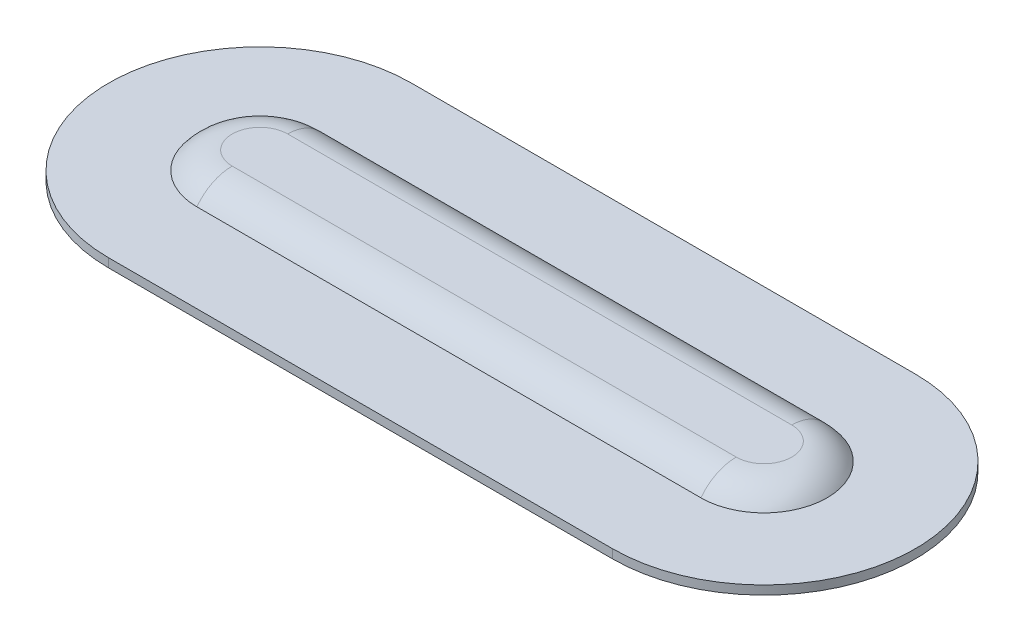
ISO-10303-21;
HEADER;
FILE_DESCRIPTION(('STEP AP214'),'2;1');
FILE_NAME('part.step','',(''),(''),'','','');
FILE_SCHEMA(('AUTOMOTIVE_DESIGN { 1 0 10303 214 1 1 1 1 }'));
ENDSEC;
DATA;
#1=APPLICATION_CONTEXT('core data for automotive mechanical design processes');
#2=APPLICATION_PROTOCOL_DEFINITION('international standard','automotive_design',2000,#1);
#3=PRODUCT_CONTEXT('',#1,'mechanical');
#4=PRODUCT('Part','Part','',(#3));
#5=PRODUCT_RELATED_PRODUCT_CATEGORY('part','',(#4));
#6=PRODUCT_DEFINITION_FORMATION('','',#4);
#7=PRODUCT_DEFINITION_CONTEXT('part definition',#1,'design');
#8=PRODUCT_DEFINITION('design','',#6,#7);
#9=PRODUCT_DEFINITION_SHAPE('','',#8);
#10=(LENGTH_UNIT() NAMED_UNIT(*) SI_UNIT(.MILLI.,.METRE.));
#11=(NAMED_UNIT(*) PLANE_ANGLE_UNIT() SI_UNIT($,.RADIAN.));
#12=(NAMED_UNIT(*) SI_UNIT($,.STERADIAN.) SOLID_ANGLE_UNIT());
#13=UNCERTAINTY_MEASURE_WITH_UNIT(LENGTH_MEASURE(1.E-05),#10,'distance_accuracy_value','');
#14=(GEOMETRIC_REPRESENTATION_CONTEXT(3) GLOBAL_UNCERTAINTY_ASSIGNED_CONTEXT((#13)) GLOBAL_UNIT_ASSIGNED_CONTEXT((#10,
#11,#12)) REPRESENTATION_CONTEXT('',''));
#15=CARTESIAN_POINT('',(0.,0.,0.));
#16=DIRECTION('',(0.,0.,1.));
#17=DIRECTION('',(1.,0.,0.));
#18=AXIS2_PLACEMENT_3D('',#15,#16,#17);
#19=CARTESIAN_POINT('',(-28.55625,1.,0.));
#20=DIRECTION('',(0.,-1.,0.));
#21=DIRECTION('',(0.,0.,-1.));
#22=AXIS2_PLACEMENT_3D('',#19,#20,#21);
#23=CYLINDRICAL_SURFACE('',#22,17.1489758704796);
#24=CARTESIAN_POINT('',(-28.55625,0.,0.));
#25=DIRECTION('',(0.,1.,0.));
#26=DIRECTION('',(0.,0.,1.));
#27=AXIS2_PLACEMENT_3D('',#24,#25,#26);
#28=CIRCLE('',#27,17.1489758704796);
#29=CARTESIAN_POINT('',(-28.55625,0.,-17.1489758704796));
#30=VERTEX_POINT('',#29);
#31=CARTESIAN_POINT('',(-28.55625,0.,17.1489758704796));
#32=VERTEX_POINT('',#31);
#33=EDGE_CURVE('E184',#30,#32,#28,.T.);
#34=ORIENTED_EDGE('',*,*,#33,.T.);
#35=DIRECTION('',(0.,-1.,0.));
#36=VECTOR('',#35,1.);
#37=CARTESIAN_POINT('',(-28.55625,1.,17.1489758704796));
#38=LINE('',#37,#36);
#39=CARTESIAN_POINT('',(-28.55625,1.,17.1489758704796));
#40=VERTEX_POINT('',#39);
#41=EDGE_CURVE('E169',#40,#32,#38,.T.);
#42=ORIENTED_EDGE('',*,*,#41,.F.);
#43=CARTESIAN_POINT('',(-28.55625,1.,0.));
#44=DIRECTION('',(0.,1.,0.));
#45=DIRECTION('',(0.,0.,1.));
#46=AXIS2_PLACEMENT_3D('',#43,#44,#45);
#47=CIRCLE('',#46,17.1489758704796);
#48=CARTESIAN_POINT('',(-28.55625,1.,-17.1489758704796));
#49=VERTEX_POINT('',#48);
#50=EDGE_CURVE('E192',#49,#40,#47,.T.);
#51=ORIENTED_EDGE('',*,*,#50,.F.);
#52=DIRECTION('',(0.,-1.,0.));
#53=VECTOR('',#52,1.);
#54=CARTESIAN_POINT('',(-28.55625,1.,-17.1489758704796));
#55=LINE('',#54,#53);
#56=EDGE_CURVE('E266',#49,#30,#55,.T.);
#57=ORIENTED_EDGE('',*,*,#56,.T.);
#58=EDGE_LOOP('',(#34,#42,#51,#57));
#59=FACE_BOUND('',#58,.T.);
#60=ADVANCED_FACE('F42',(#59),#23,.T.);
#61=CARTESIAN_POINT('',(-28.55625,1.,17.1489758704796));
#62=DIRECTION('',(0.,0.,-1.));
#63=DIRECTION('',(-1.,0.,0.));
#64=AXIS2_PLACEMENT_3D('',#61,#62,#63);
#65=PLANE('',#64);
#66=DIRECTION('',(1.,0.,0.));
#67=VECTOR('',#66,1.);
#68=CARTESIAN_POINT('',(-28.55625,0.,17.1489758704796));
#69=LINE('',#68,#67);
#70=CARTESIAN_POINT('',(28.55625,0.,17.1489758704796));
#71=VERTEX_POINT('',#70);
#72=EDGE_CURVE('E187',#32,#71,#69,.T.);
#73=ORIENTED_EDGE('',*,*,#72,.T.);
#74=DIRECTION('',(0.,-1.,0.));
#75=VECTOR('',#74,1.);
#76=CARTESIAN_POINT('',(28.55625,1.,17.1489758704796));
#77=LINE('',#76,#75);
#78=CARTESIAN_POINT('',(28.55625,1.,17.1489758704796));
#79=VERTEX_POINT('',#78);
#80=EDGE_CURVE('E174',#79,#71,#77,.T.);
#81=ORIENTED_EDGE('',*,*,#80,.F.);
#82=DIRECTION('',(1.,0.,0.));
#83=VECTOR('',#82,1.);
#84=CARTESIAN_POINT('',(-28.55625,1.,17.1489758704796));
#85=LINE('',#84,#83);
#86=EDGE_CURVE('E436',#40,#79,#85,.T.);
#87=ORIENTED_EDGE('',*,*,#86,.F.);
#88=ORIENTED_EDGE('',*,*,#41,.T.);
#89=EDGE_LOOP('',(#73,#81,#87,#88));
#90=FACE_BOUND('',#89,.T.);
#91=ADVANCED_FACE('F451',(#90),#65,.F.);
#92=CARTESIAN_POINT('',(28.55625,1.,0.));
#93=DIRECTION('',(0.,-1.,0.));
#94=DIRECTION('',(0.,0.,-1.));
#95=AXIS2_PLACEMENT_3D('',#92,#93,#94);
#96=CYLINDRICAL_SURFACE('',#95,17.1489758704796);
#97=CARTESIAN_POINT('',(28.55625,0.,0.));
#98=DIRECTION('',(0.,1.,0.));
#99=DIRECTION('',(0.,0.,1.));
#100=AXIS2_PLACEMENT_3D('',#97,#98,#99);
#101=CIRCLE('',#100,17.1489758704796);
#102=CARTESIAN_POINT('',(28.55625,0.,-17.1489758704796));
#103=VERTEX_POINT('',#102);
#104=EDGE_CURVE('E214',#71,#103,#101,.T.);
#105=ORIENTED_EDGE('',*,*,#104,.T.);
#106=DIRECTION('',(0.,-1.,0.));
#107=VECTOR('',#106,1.);
#108=CARTESIAN_POINT('',(28.55625,1.,-17.1489758704796));
#109=LINE('',#108,#107);
#110=CARTESIAN_POINT('',(28.55625,1.,-17.1489758704796));
#111=VERTEX_POINT('',#110);
#112=EDGE_CURVE('E269',#111,#103,#109,.T.);
#113=ORIENTED_EDGE('',*,*,#112,.F.);
#114=CARTESIAN_POINT('',(28.55625,1.,0.));
#115=DIRECTION('',(0.,1.,0.));
#116=DIRECTION('',(0.,0.,1.));
#117=AXIS2_PLACEMENT_3D('',#114,#115,#116);
#118=CIRCLE('',#117,17.1489758704796);
#119=EDGE_CURVE('E425',#79,#111,#118,.T.);
#120=ORIENTED_EDGE('',*,*,#119,.F.);
#121=ORIENTED_EDGE('',*,*,#80,.T.);
#122=EDGE_LOOP('',(#105,#113,#120,#121));
#123=FACE_BOUND('',#122,.T.);
#124=ADVANCED_FACE('F424',(#123),#96,.T.);
#125=CARTESIAN_POINT('',(-28.55625,1.,-17.1489758704796));
#126=DIRECTION('',(0.,0.,1.));
#127=DIRECTION('',(1.,0.,0.));
#128=AXIS2_PLACEMENT_3D('',#125,#126,#127);
#129=PLANE('',#128);
#130=DIRECTION('',(-1.,0.,0.));
#131=VECTOR('',#130,1.);
#132=CARTESIAN_POINT('',(-28.55625,0.,-17.1489758704796));
#133=LINE('',#132,#131);
#134=EDGE_CURVE('E264',#103,#30,#133,.T.);
#135=ORIENTED_EDGE('',*,*,#134,.T.);
#136=ORIENTED_EDGE('',*,*,#56,.F.);
#137=DIRECTION('',(-1.,0.,0.));
#138=VECTOR('',#137,1.);
#139=CARTESIAN_POINT('',(-28.55625,1.,-17.1489758704796));
#140=LINE('',#139,#138);
#141=EDGE_CURVE('E210',#111,#49,#140,.T.);
#142=ORIENTED_EDGE('',*,*,#141,.F.);
#143=ORIENTED_EDGE('',*,*,#112,.T.);
#144=EDGE_LOOP('',(#135,#136,#142,#143));
#145=FACE_BOUND('',#144,.T.);
#146=ADVANCED_FACE('F431',(#145),#129,.F.);
#147=CARTESIAN_POINT('',(-28.55625,1.,0.));
#148=DIRECTION('',(0.,1.,0.));
#149=DIRECTION('',(0.,0.,1.));
#150=AXIS2_PLACEMENT_3D('',#147,#148,#149);
#151=PLANE('',#150);
#152=CARTESIAN_POINT('',(-28.55625,1.,0.));
#153=DIRECTION('',(0.,1.,0.));
#154=DIRECTION('',(0.,0.,1.));
#155=AXIS2_PLACEMENT_3D('',#152,#153,#154);
#156=CIRCLE('',#155,7.14897587047956);
#157=CARTESIAN_POINT('',(-28.55625,1.,-7.14897587047957));
#158=VERTEX_POINT('',#157);
#159=CARTESIAN_POINT('',(-28.55625,1.,7.14897587047955));
#160=VERTEX_POINT('',#159);
#161=EDGE_CURVE('E123',#158,#160,#156,.T.);
#162=ORIENTED_EDGE('',*,*,#161,.F.);
#163=DIRECTION('',(-1.,0.,0.));
#164=VECTOR('',#163,1.);
#165=CARTESIAN_POINT('',(28.55625,1.,-7.14897587047956));
#166=LINE('',#165,#164);
#167=CARTESIAN_POINT('',(28.55625,1.,-7.14897587047956));
#168=VERTEX_POINT('',#167);
#169=EDGE_CURVE('E115',#168,#158,#166,.T.);
#170=ORIENTED_EDGE('',*,*,#169,.F.);
#171=CARTESIAN_POINT('',(28.55625,1.,0.));
#172=DIRECTION('',(0.,1.,0.));
#173=DIRECTION('',(0.,0.,1.));
#174=AXIS2_PLACEMENT_3D('',#171,#172,#173);
#175=CIRCLE('',#174,7.14897587047956);
#176=CARTESIAN_POINT('',(28.55625,1.,7.14897587047955));
#177=VERTEX_POINT('',#176);
#178=EDGE_CURVE('E108',#177,#168,#175,.T.);
#179=ORIENTED_EDGE('',*,*,#178,.F.);
#180=DIRECTION('',(1.,0.,0.));
#181=VECTOR('',#180,1.);
#182=CARTESIAN_POINT('',(-28.55625,1.,7.14897587047955));
#183=LINE('',#182,#181);
#184=EDGE_CURVE('E112',#160,#177,#183,.T.);
#185=ORIENTED_EDGE('',*,*,#184,.F.);
#186=EDGE_LOOP('',(#162,#170,#179,#185));
#187=FACE_BOUND('',#186,.T.);
#188=ORIENTED_EDGE('',*,*,#50,.T.);
#189=ORIENTED_EDGE('',*,*,#86,.T.);
#190=ORIENTED_EDGE('',*,*,#119,.T.);
#191=ORIENTED_EDGE('',*,*,#141,.T.);
#192=EDGE_LOOP('',(#188,#189,#190,#191));
#193=FACE_BOUND('',#192,.T.);
#194=ADVANCED_FACE('F110',(#187,#193),#151,.T.);
#195=CARTESIAN_POINT('',(-28.55625,0.,0.));
#196=DIRECTION('',(0.,1.,0.));
#197=DIRECTION('',(0.,0.,1.));
#198=AXIS2_PLACEMENT_3D('',#195,#196,#197);
#199=PLANE('',#198);
#200=ORIENTED_EDGE('',*,*,#33,.F.);
#201=ORIENTED_EDGE('',*,*,#134,.F.);
#202=ORIENTED_EDGE('',*,*,#104,.F.);
#203=ORIENTED_EDGE('',*,*,#72,.F.);
#204=EDGE_LOOP('',(#200,#201,#202,#203));
#205=FACE_BOUND('',#204,.T.);
#206=ADVANCED_FACE('F429',(#205),#199,.F.);
#207=CARTESIAN_POINT('',(-28.55625,3.,0.));
#208=DIRECTION('',(0.,1.,0.));
#209=DIRECTION('',(0.,0.,1.));
#210=AXIS2_PLACEMENT_3D('',#207,#208,#209);
#211=PLANE('',#210);
#212=CARTESIAN_POINT('',(28.55625,3.,0.));
#213=DIRECTION('',(0.,1.,0.));
#214=DIRECTION('',(0.,0.,1.));
#215=AXIS2_PLACEMENT_3D('',#212,#213,#214);
#216=CIRCLE('',#215,3.14897587047956);
#217=CARTESIAN_POINT('',(28.55625,3.,3.14897587047955));
#218=VERTEX_POINT('',#217);
#219=CARTESIAN_POINT('',(28.55625,3.,-3.14897587047956));
#220=VERTEX_POINT('',#219);
#221=EDGE_CURVE('E52',#218,#220,#216,.T.);
#222=ORIENTED_EDGE('',*,*,#221,.T.);
#223=DIRECTION('',(1.,0.,0.));
#224=VECTOR('',#223,1.);
#225=CARTESIAN_POINT('',(-28.55625,3.,-3.14897587047957));
#226=LINE('',#225,#224);
#227=CARTESIAN_POINT('',(-28.55625,3.,-3.14897587047956));
#228=VERTEX_POINT('',#227);
#229=EDGE_CURVE('E12',#220,#228,#226,.F.);
#230=ORIENTED_EDGE('',*,*,#229,.T.);
#231=CARTESIAN_POINT('',(-28.55625,3.,0.));
#232=DIRECTION('',(0.,1.,0.));
#233=DIRECTION('',(0.,0.,1.));
#234=AXIS2_PLACEMENT_3D('',#231,#232,#233);
#235=CIRCLE('',#234,3.14897587047956);
#236=CARTESIAN_POINT('',(-28.55625,3.,3.14897587047956));
#237=VERTEX_POINT('',#236);
#238=EDGE_CURVE('E173',#228,#237,#235,.T.);
#239=ORIENTED_EDGE('',*,*,#238,.T.);
#240=DIRECTION('',(-1.,0.,0.));
#241=VECTOR('',#240,1.);
#242=CARTESIAN_POINT('',(28.55625,3.,3.14897587047955));
#243=LINE('',#242,#241);
#244=EDGE_CURVE('E63',#237,#218,#243,.F.);
#245=ORIENTED_EDGE('',*,*,#244,.T.);
#246=EDGE_LOOP('',(#222,#230,#239,#245));
#247=FACE_BOUND('',#246,.T.);
#248=ADVANCED_FACE('F178',(#247),#211,.T.);
#249=CARTESIAN_POINT('',(-28.55625,-2.,3.14897587047955));
#250=DIRECTION('',(1.,0.,0.));
#251=DIRECTION('',(0.,0.,-1.));
#252=AXIS2_PLACEMENT_3D('',#249,#250,#251);
#253=CYLINDRICAL_SURFACE('',#252,5.);
#254=CARTESIAN_POINT('',(-28.55625,-2.,3.14897587047955));
#255=DIRECTION('',(-1.,0.,0.));
#256=DIRECTION('',(0.,0.,1.));
#257=AXIS2_PLACEMENT_3D('',#254,#255,#256);
#258=CIRCLE('',#257,5.);
#259=EDGE_CURVE('E121',#160,#237,#258,.T.);
#260=ORIENTED_EDGE('',*,*,#259,.F.);
#261=ORIENTED_EDGE('',*,*,#184,.T.);
#262=CARTESIAN_POINT('',(28.55625,-2.,3.14897587047955));
#263=DIRECTION('',(1.,0.,0.));
#264=DIRECTION('',(0.,0.,-1.));
#265=AXIS2_PLACEMENT_3D('',#262,#263,#264);
#266=CIRCLE('',#265,5.);
#267=EDGE_CURVE('E46',#218,#177,#266,.T.);
#268=ORIENTED_EDGE('',*,*,#267,.F.);
#269=ORIENTED_EDGE('',*,*,#244,.F.);
#270=EDGE_LOOP('',(#260,#261,#268,#269));
#271=FACE_BOUND('',#270,.T.);
#272=ADVANCED_FACE('F44',(#271),#253,.T.);
#273=CARTESIAN_POINT('',(28.55625,-2.,0.));
#274=DIRECTION('',(0.,-1.,0.));
#275=DIRECTION('',(0.,0.,-1.));
#276=AXIS2_PLACEMENT_3D('',#273,#274,#275);
#277=DEGENERATE_TOROIDAL_SURFACE('',#276,3.14897587047956,5.,.T.);
#278=ORIENTED_EDGE('',*,*,#267,.T.);
#279=ORIENTED_EDGE('',*,*,#178,.T.);
#280=CARTESIAN_POINT('',(28.55625,-2.,-3.14897587047956));
#281=DIRECTION('',(-1.,0.,0.));
#282=DIRECTION('',(0.,0.,1.));
#283=AXIS2_PLACEMENT_3D('',#280,#281,#282);
#284=CIRCLE('',#283,5.);
#285=EDGE_CURVE('E127',#220,#168,#284,.T.);
#286=ORIENTED_EDGE('',*,*,#285,.F.);
#287=ORIENTED_EDGE('',*,*,#221,.F.);
#288=EDGE_LOOP('',(#278,#279,#286,#287));
#289=FACE_BOUND('',#288,.T.);
#290=ADVANCED_FACE('F125',(#289),#277,.T.);
#291=CARTESIAN_POINT('',(-28.55625,-2.,0.));
#292=DIRECTION('',(0.,-1.,0.));
#293=DIRECTION('',(0.,0.,-1.));
#294=AXIS2_PLACEMENT_3D('',#291,#292,#293);
#295=DEGENERATE_TOROIDAL_SURFACE('',#294,3.14897587047956,5.,.T.);
#296=ORIENTED_EDGE('',*,*,#259,.T.);
#297=ORIENTED_EDGE('',*,*,#238,.F.);
#298=CARTESIAN_POINT('',(-28.55625,-2.,-3.14897587047957));
#299=DIRECTION('',(1.,0.,0.));
#300=DIRECTION('',(0.,0.,-1.));
#301=AXIS2_PLACEMENT_3D('',#298,#299,#300);
#302=CIRCLE('',#301,5.);
#303=EDGE_CURVE('E130',#158,#228,#302,.T.);
#304=ORIENTED_EDGE('',*,*,#303,.F.);
#305=ORIENTED_EDGE('',*,*,#161,.T.);
#306=EDGE_LOOP('',(#296,#297,#304,#305));
#307=FACE_BOUND('',#306,.T.);
#308=ADVANCED_FACE('F181',(#307),#295,.T.);
#309=CARTESIAN_POINT('',(28.55625,-2.,-3.14897587047956));
#310=DIRECTION('',(-1.,0.,0.));
#311=DIRECTION('',(0.,0.,1.));
#312=AXIS2_PLACEMENT_3D('',#309,#310,#311);
#313=CYLINDRICAL_SURFACE('',#312,5.);
#314=ORIENTED_EDGE('',*,*,#285,.T.);
#315=ORIENTED_EDGE('',*,*,#169,.T.);
#316=ORIENTED_EDGE('',*,*,#303,.T.);
#317=ORIENTED_EDGE('',*,*,#229,.F.);
#318=EDGE_LOOP('',(#314,#315,#316,#317));
#319=FACE_BOUND('',#318,.T.);
#320=ADVANCED_FACE('F183',(#319),#313,.T.);
#321=CLOSED_SHELL('',(#60,#91,#124,#146,#194,#206,#248,#272,#290,#308,#320));
#322=MANIFOLD_SOLID_BREP('B2',#321);
#323=ADVANCED_BREP_SHAPE_REPRESENTATION('',(#18,#322),#14);
#324=SHAPE_DEFINITION_REPRESENTATION(#9,#323);
ENDSEC;
END-ISO-10303-21;
